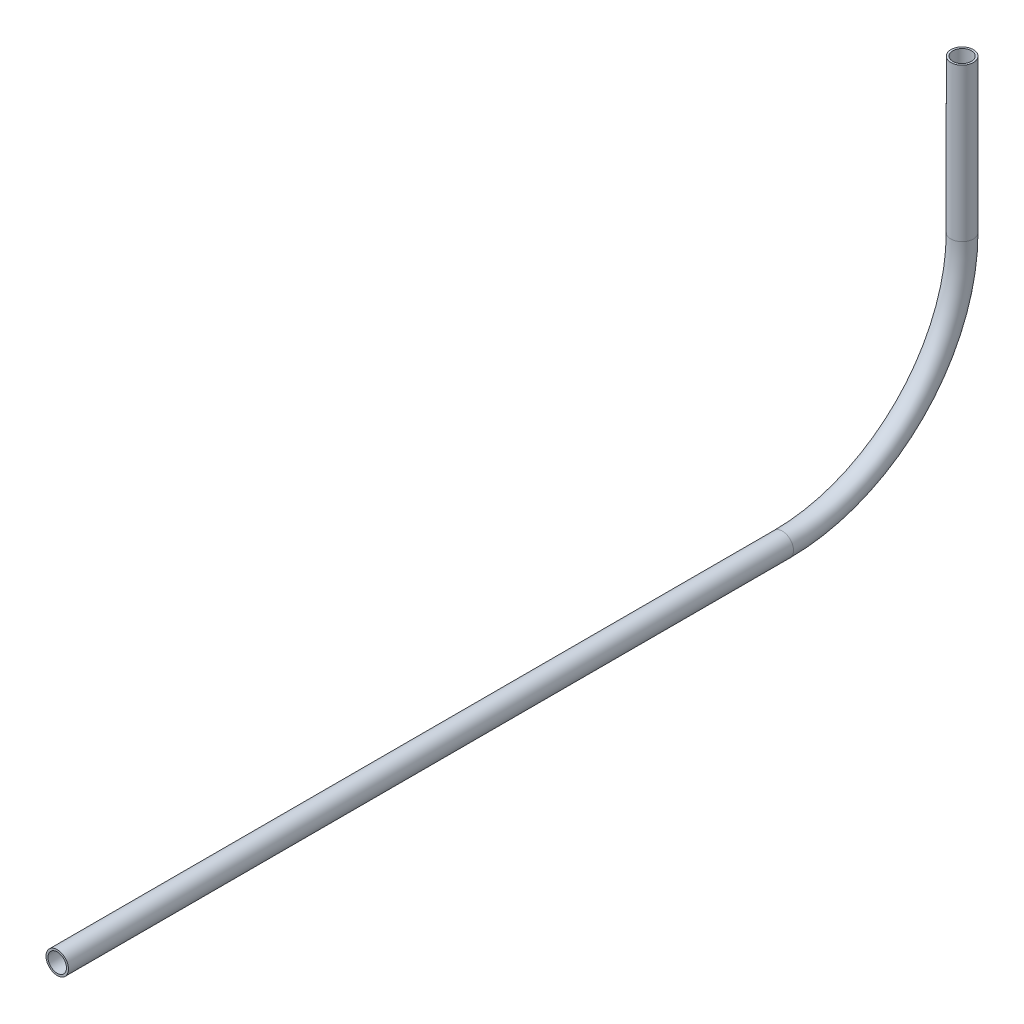
ISO-10303-21;
HEADER;
FILE_DESCRIPTION(('STEP AP214'),'2;1');
FILE_NAME('part.step','',(''),(''),'','','');
FILE_SCHEMA(('AUTOMOTIVE_DESIGN { 1 0 10303 214 1 1 1 1 }'));
ENDSEC;
DATA;
#1=APPLICATION_CONTEXT('core data for automotive mechanical design processes');
#2=APPLICATION_PROTOCOL_DEFINITION('international standard','automotive_design',2000,#1);
#3=PRODUCT_CONTEXT('',#1,'mechanical');
#4=PRODUCT('Part','Part','',(#3));
#5=PRODUCT_RELATED_PRODUCT_CATEGORY('part','',(#4));
#6=PRODUCT_DEFINITION_FORMATION('','',#4);
#7=PRODUCT_DEFINITION_CONTEXT('part definition',#1,'design');
#8=PRODUCT_DEFINITION('design','',#6,#7);
#9=PRODUCT_DEFINITION_SHAPE('','',#8);
#10=(LENGTH_UNIT() NAMED_UNIT(*) SI_UNIT(.MILLI.,.METRE.));
#11=(NAMED_UNIT(*) PLANE_ANGLE_UNIT() SI_UNIT($,.RADIAN.));
#12=(NAMED_UNIT(*) SI_UNIT($,.STERADIAN.) SOLID_ANGLE_UNIT());
#13=UNCERTAINTY_MEASURE_WITH_UNIT(LENGTH_MEASURE(1.E-05),#10,'distance_accuracy_value','');
#14=(GEOMETRIC_REPRESENTATION_CONTEXT(3) GLOBAL_UNCERTAINTY_ASSIGNED_CONTEXT((#13)) GLOBAL_UNIT_ASSIGNED_CONTEXT((#10,
#11,#12)) REPRESENTATION_CONTEXT('',''));
#15=CARTESIAN_POINT('',(0.,0.,0.));
#16=DIRECTION('',(0.,0.,1.));
#17=DIRECTION('',(1.,0.,0.));
#18=AXIS2_PLACEMENT_3D('',#15,#16,#17);
#19=CARTESIAN_POINT('',(0.,165.169649271775,54.1650778381116));
#20=DIRECTION('',(0.,0.,1.));
#21=DIRECTION('',(0.,-1.,0.));
#22=AXIS2_PLACEMENT_3D('',#19,#20,#21);
#23=CYLINDRICAL_SURFACE('',#22,2.61619999999999);
#24=CARTESIAN_POINT('',(0.,165.169649271775,258.995340327516));
#25=DIRECTION('',(0.,0.,-1.));
#26=DIRECTION('',(0.,1.,0.));
#27=AXIS2_PLACEMENT_3D('',#24,#25,#26);
#28=CIRCLE('',#27,2.61619999999999);
#29=CARTESIAN_POINT('',(0.,167.785849271775,258.995340327516));
#30=VERTEX_POINT('',#29);
#31=EDGE_CURVE('E55',#30,#30,#28,.T.);
#32=ORIENTED_EDGE('',*,*,#31,.F.);
#33=EDGE_LOOP('',(#32));
#34=FACE_BOUND('',#33,.T.);
#35=CARTESIAN_POINT('',(0.,165.169649271775,54.1650778381116));
#36=DIRECTION('',(0.,0.,-1.));
#37=DIRECTION('',(0.,1.,0.));
#38=AXIS2_PLACEMENT_3D('',#35,#36,#37);
#39=CIRCLE('',#38,2.61619999999999);
#40=CARTESIAN_POINT('',(0.,167.785849271775,54.1650778381116));
#41=VERTEX_POINT('',#40);
#42=EDGE_CURVE('E51',#41,#41,#39,.T.);
#43=ORIENTED_EDGE('',*,*,#42,.T.);
#44=EDGE_LOOP('',(#43));
#45=FACE_BOUND('',#44,.T.);
#46=ADVANCED_FACE('F47',(#34,#45),#23,.F.);
#47=CARTESIAN_POINT('',(0.,165.169649271775,54.1650778381116));
#48=DIRECTION('',(0.,0.,1.));
#49=DIRECTION('',(0.,-1.,0.));
#50=AXIS2_PLACEMENT_3D('',#47,#48,#49);
#51=CYLINDRICAL_SURFACE('',#50,3.175);
#52=CARTESIAN_POINT('',(0.,165.169649271775,258.995340327516));
#53=DIRECTION('',(0.,0.,-1.));
#54=DIRECTION('',(0.,1.,0.));
#55=AXIS2_PLACEMENT_3D('',#52,#53,#54);
#56=CIRCLE('',#55,3.175);
#57=CARTESIAN_POINT('',(0.,168.344649271775,258.995340327516));
#58=VERTEX_POINT('',#57);
#59=EDGE_CURVE('E59',#58,#58,#56,.T.);
#60=ORIENTED_EDGE('',*,*,#59,.T.);
#61=EDGE_LOOP('',(#60));
#62=FACE_BOUND('',#61,.T.);
#63=CARTESIAN_POINT('',(0.,165.169649271775,54.1650778381116));
#64=DIRECTION('',(0.,0.,-1.));
#65=DIRECTION('',(0.,1.,0.));
#66=AXIS2_PLACEMENT_3D('',#63,#64,#65);
#67=CIRCLE('',#66,3.175);
#68=CARTESIAN_POINT('',(0.,168.344649271775,54.1650778381116));
#69=VERTEX_POINT('',#68);
#70=EDGE_CURVE('E12',#69,#69,#67,.T.);
#71=ORIENTED_EDGE('',*,*,#70,.F.);
#72=EDGE_LOOP('',(#71));
#73=FACE_BOUND('',#72,.T.);
#74=ADVANCED_FACE('F74',(#62,#73),#51,.T.);
#75=CARTESIAN_POINT('',(0.,165.169649271775,258.995340327516));
#76=DIRECTION('',(0.,0.,-1.));
#77=DIRECTION('',(0.,1.,0.));
#78=AXIS2_PLACEMENT_3D('',#75,#76,#77);
#79=PLANE('',#78);
#80=ORIENTED_EDGE('',*,*,#31,.T.);
#81=EDGE_LOOP('',(#80));
#82=FACE_BOUND('',#81,.T.);
#83=ORIENTED_EDGE('',*,*,#59,.F.);
#84=EDGE_LOOP('',(#83));
#85=FACE_BOUND('',#84,.T.);
#86=ADVANCED_FACE('F70',(#82,#85),#79,.F.);
#87=CARTESIAN_POINT('',(0.,165.169649271775,54.1650778381116));
#88=DIRECTION('',(0.,0.,-1.));
#89=DIRECTION('',(0.,1.,0.));
#90=AXIS2_PLACEMENT_3D('',#87,#88,#89);
#91=PLANE('',#90);
#92=ORIENTED_EDGE('',*,*,#42,.F.);
#93=EDGE_LOOP('',(#92));
#94=FACE_BOUND('',#93,.T.);
#95=ORIENTED_EDGE('',*,*,#70,.T.);
#96=EDGE_LOOP('',(#95));
#97=FACE_BOUND('',#96,.T.);
#98=ADVANCED_FACE('F49',(#94,#97),#91,.T.);
#99=CLOSED_SHELL('',(#46,#74,#86,#98));
#100=MANIFOLD_SOLID_BREP('B2',#99);
#101=CARTESIAN_POINT('',(0.,215.969649271775,54.1650778381116));
#102=DIRECTION('',(-1.,0.,0.));
#103=DIRECTION('',(0.,0.,1.));
#104=AXIS2_PLACEMENT_3D('',#101,#102,#103);
#105=TOROIDAL_SURFACE('',#104,50.8,2.61619999999999);
#106=CARTESIAN_POINT('',(0.,215.969649271775,3.3650778381116));
#107=DIRECTION('',(0.,1.,0.));
#108=DIRECTION('',(0.,0.,1.));
#109=AXIS2_PLACEMENT_3D('',#106,#107,#108);
#110=CIRCLE('',#109,2.61619999999999);
#111=CARTESIAN_POINT('',(0.,215.969649271775,0.74887783811161));
#112=VERTEX_POINT('',#111);
#113=EDGE_CURVE('E150',#112,#112,#110,.T.);
#114=CARTESIAN_POINT('',(0.,165.169649271775,54.1650778381116));
#115=DIRECTION('',(0.,0.,1.));
#116=DIRECTION('',(0.,-1.,0.));
#117=AXIS2_PLACEMENT_3D('',#114,#115,#116);
#118=CIRCLE('',#117,2.61619999999999);
#119=CARTESIAN_POINT('',(0.,162.553449271775,54.1650778381116));
#120=VERTEX_POINT('',#119);
#121=EDGE_CURVE('E140',#120,#120,#118,.T.);
#122=CARTESIAN_POINT('',(0.,215.969649271775,54.1650778381116));
#123=DIRECTION('',(-1.,0.,0.));
#124=DIRECTION('',(0.,0.,1.));
#125=AXIS2_PLACEMENT_3D('',#122,#123,#124);
#126=CIRCLE('',#125,53.4162);
#127=EDGE_CURVE('',#112,#120,#126,.T.);
#128=ORIENTED_EDGE('',*,*,#113,.T.);
#129=ORIENTED_EDGE('',*,*,#121,.T.);
#130=ORIENTED_EDGE('',*,*,#127,.T.);
#131=ORIENTED_EDGE('',*,*,#127,.F.);
#132=EDGE_LOOP('',(#128,#130,#129,#131));
#133=FACE_BOUND('',#132,.T.);
#134=ADVANCED_FACE('F136',(#133),#105,.F.);
#135=CARTESIAN_POINT('',(0.,215.969649271775,54.1650778381116));
#136=DIRECTION('',(-1.,0.,0.));
#137=DIRECTION('',(0.,0.,1.));
#138=AXIS2_PLACEMENT_3D('',#135,#136,#137);
#139=TOROIDAL_SURFACE('',#138,50.8,3.175);
#140=CARTESIAN_POINT('',(0.,215.969649271775,3.3650778381116));
#141=DIRECTION('',(0.,1.,0.));
#142=DIRECTION('',(0.,0.,1.));
#143=AXIS2_PLACEMENT_3D('',#140,#141,#142);
#144=CIRCLE('',#143,3.175);
#145=CARTESIAN_POINT('',(0.,215.969649271775,0.190077838111605));
#146=VERTEX_POINT('',#145);
#147=EDGE_CURVE('E144',#146,#146,#144,.T.);
#148=CARTESIAN_POINT('',(0.,165.169649271775,54.1650778381116));
#149=DIRECTION('',(0.,0.,1.));
#150=DIRECTION('',(0.,-1.,0.));
#151=AXIS2_PLACEMENT_3D('',#148,#149,#150);
#152=CIRCLE('',#151,3.175);
#153=CARTESIAN_POINT('',(0.,161.994649271775,54.1650778381116));
#154=VERTEX_POINT('',#153);
#155=EDGE_CURVE('E46',#154,#154,#152,.T.);
#156=CARTESIAN_POINT('',(0.,215.969649271775,54.1650778381116));
#157=DIRECTION('',(-1.,0.,0.));
#158=DIRECTION('',(0.,0.,1.));
#159=AXIS2_PLACEMENT_3D('',#156,#157,#158);
#160=CIRCLE('',#159,53.975);
#161=EDGE_CURVE('',#146,#154,#160,.T.);
#162=ORIENTED_EDGE('',*,*,#147,.F.);
#163=ORIENTED_EDGE('',*,*,#155,.F.);
#164=ORIENTED_EDGE('',*,*,#161,.T.);
#165=ORIENTED_EDGE('',*,*,#161,.F.);
#166=EDGE_LOOP('',(#162,#164,#163,#165));
#167=FACE_BOUND('',#166,.T.);
#168=ADVANCED_FACE('F163',(#167),#139,.T.);
#169=CARTESIAN_POINT('',(0.,215.969649271775,3.36507783811159));
#170=DIRECTION('',(0.,1.,0.));
#171=DIRECTION('',(0.,0.,1.));
#172=AXIS2_PLACEMENT_3D('',#169,#170,#171);
#173=PLANE('',#172);
#174=ORIENTED_EDGE('',*,*,#113,.F.);
#175=EDGE_LOOP('',(#174));
#176=FACE_BOUND('',#175,.T.);
#177=ORIENTED_EDGE('',*,*,#147,.T.);
#178=EDGE_LOOP('',(#177));
#179=FACE_BOUND('',#178,.T.);
#180=ADVANCED_FACE('F159',(#176,#179),#173,.T.);
#181=CARTESIAN_POINT('',(0.,165.169649271775,54.1650778381116));
#182=DIRECTION('',(0.,0.,1.));
#183=DIRECTION('',(0.,-1.,0.));
#184=AXIS2_PLACEMENT_3D('',#181,#182,#183);
#185=PLANE('',#184);
#186=ORIENTED_EDGE('',*,*,#121,.F.);
#187=EDGE_LOOP('',(#186));
#188=FACE_BOUND('',#187,.T.);
#189=ORIENTED_EDGE('',*,*,#155,.T.);
#190=EDGE_LOOP('',(#189));
#191=FACE_BOUND('',#190,.T.);
#192=ADVANCED_FACE('F138',(#188,#191),#185,.T.);
#193=CLOSED_SHELL('',(#134,#168,#180,#192));
#194=MANIFOLD_SOLID_BREP('B7',#193);
#195=CARTESIAN_POINT('',(0.,259.14455812412,3.3650778381116));
#196=DIRECTION('',(0.,-1.,0.));
#197=DIRECTION('',(0.,0.,-1.));
#198=AXIS2_PLACEMENT_3D('',#195,#196,#197);
#199=CYLINDRICAL_SURFACE('',#198,2.61619999999999);
#200=CARTESIAN_POINT('',(0.,259.14455812412,3.3650778381116));
#201=DIRECTION('',(0.,1.,0.));
#202=DIRECTION('',(0.,0.,1.));
#203=AXIS2_PLACEMENT_3D('',#200,#201,#202);
#204=CIRCLE('',#203,2.61619999999999);
#205=CARTESIAN_POINT('',(0.,259.14455812412,5.98127783811159));
#206=VERTEX_POINT('',#205);
#207=EDGE_CURVE('E234',#206,#206,#204,.T.);
#208=ORIENTED_EDGE('',*,*,#207,.T.);
#209=EDGE_LOOP('',(#208));
#210=FACE_BOUND('',#209,.T.);
#211=CARTESIAN_POINT('',(0.,215.969649271775,3.3650778381116));
#212=DIRECTION('',(0.,-1.,0.));
#213=DIRECTION('',(0.,0.,-1.));
#214=AXIS2_PLACEMENT_3D('',#211,#212,#213);
#215=CIRCLE('',#214,2.61619999999999);
#216=CARTESIAN_POINT('',(0.,215.969649271775,0.748877838111612));
#217=VERTEX_POINT('',#216);
#218=EDGE_CURVE('E224',#217,#217,#215,.T.);
#219=ORIENTED_EDGE('',*,*,#218,.T.);
#220=EDGE_LOOP('',(#219));
#221=FACE_BOUND('',#220,.T.);
#222=ADVANCED_FACE('F220',(#210,#221),#199,.F.);
#223=CARTESIAN_POINT('',(0.,259.14455812412,3.3650778381116));
#224=DIRECTION('',(0.,-1.,0.));
#225=DIRECTION('',(0.,0.,-1.));
#226=AXIS2_PLACEMENT_3D('',#223,#224,#225);
#227=CYLINDRICAL_SURFACE('',#226,3.175);
#228=CARTESIAN_POINT('',(0.,259.14455812412,3.3650778381116));
#229=DIRECTION('',(0.,1.,0.));
#230=DIRECTION('',(0.,0.,1.));
#231=AXIS2_PLACEMENT_3D('',#228,#229,#230);
#232=CIRCLE('',#231,3.175);
#233=CARTESIAN_POINT('',(0.,259.14455812412,6.5400778381116));
#234=VERTEX_POINT('',#233);
#235=EDGE_CURVE('E228',#234,#234,#232,.T.);
#236=ORIENTED_EDGE('',*,*,#235,.F.);
#237=EDGE_LOOP('',(#236));
#238=FACE_BOUND('',#237,.T.);
#239=CARTESIAN_POINT('',(0.,215.969649271775,3.3650778381116));
#240=DIRECTION('',(0.,-1.,0.));
#241=DIRECTION('',(0.,0.,-1.));
#242=AXIS2_PLACEMENT_3D('',#239,#240,#241);
#243=CIRCLE('',#242,3.175);
#244=CARTESIAN_POINT('',(0.,215.969649271775,0.190077838111604));
#245=VERTEX_POINT('',#244);
#246=EDGE_CURVE('E135',#245,#245,#243,.T.);
#247=ORIENTED_EDGE('',*,*,#246,.F.);
#248=EDGE_LOOP('',(#247));
#249=FACE_BOUND('',#248,.T.);
#250=ADVANCED_FACE('F247',(#238,#249),#227,.T.);
#251=CARTESIAN_POINT('',(0.,259.14455812412,3.3650778381116));
#252=DIRECTION('',(0.,1.,0.));
#253=DIRECTION('',(0.,0.,1.));
#254=AXIS2_PLACEMENT_3D('',#251,#252,#253);
#255=PLANE('',#254);
#256=ORIENTED_EDGE('',*,*,#207,.F.);
#257=EDGE_LOOP('',(#256));
#258=FACE_BOUND('',#257,.T.);
#259=ORIENTED_EDGE('',*,*,#235,.T.);
#260=EDGE_LOOP('',(#259));
#261=FACE_BOUND('',#260,.T.);
#262=ADVANCED_FACE('F243',(#258,#261),#255,.T.);
#263=CARTESIAN_POINT('',(0.,215.969649271775,3.36507783811159));
#264=DIRECTION('',(0.,-1.,0.));
#265=DIRECTION('',(0.,0.,-1.));
#266=AXIS2_PLACEMENT_3D('',#263,#264,#265);
#267=PLANE('',#266);
#268=ORIENTED_EDGE('',*,*,#218,.F.);
#269=EDGE_LOOP('',(#268));
#270=FACE_BOUND('',#269,.T.);
#271=ORIENTED_EDGE('',*,*,#246,.T.);
#272=EDGE_LOOP('',(#271));
#273=FACE_BOUND('',#272,.T.);
#274=ADVANCED_FACE('F222',(#270,#273),#267,.T.);
#275=CLOSED_SHELL('',(#222,#250,#262,#274));
#276=MANIFOLD_SOLID_BREP('B41',#275);
#277=ADVANCED_BREP_SHAPE_REPRESENTATION('',(#18,#100,#194,#276),#14);
#278=SHAPE_DEFINITION_REPRESENTATION(#9,#277);
ENDSEC;
END-ISO-10303-21;
